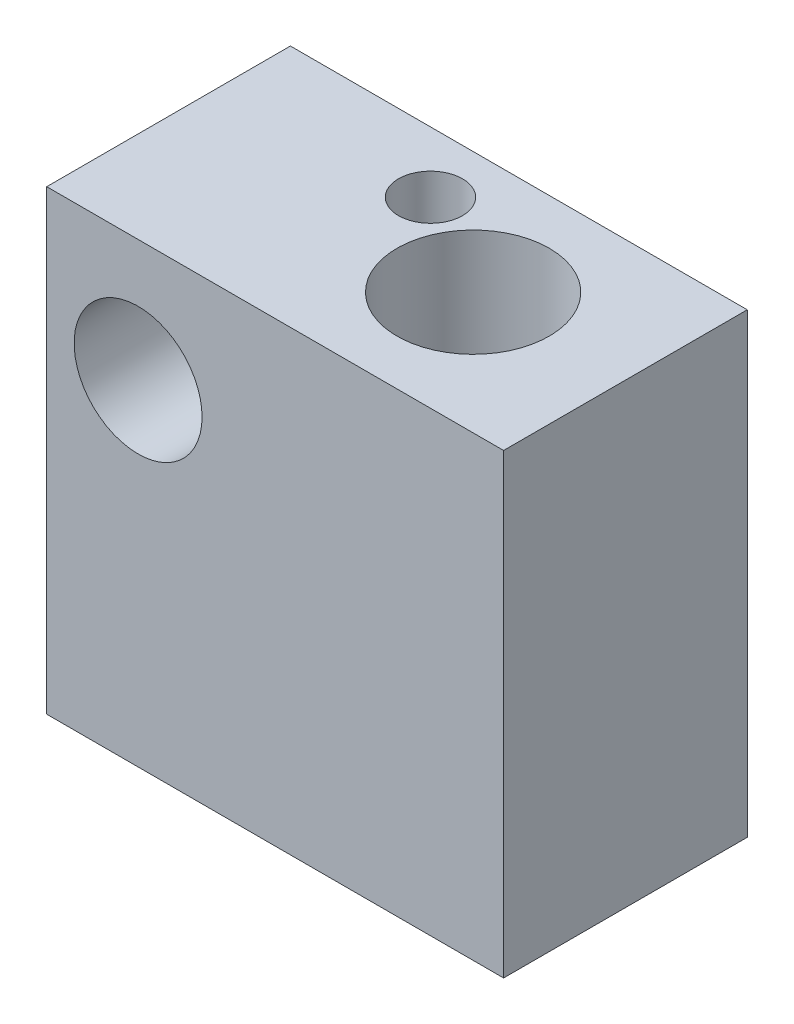
ISO-10303-21;
HEADER;
FILE_DESCRIPTION(('STEP AP214'),'2;1');
FILE_NAME('part.step','',(''),(''),'','','');
FILE_SCHEMA(('AUTOMOTIVE_DESIGN { 1 0 10303 214 1 1 1 1 }'));
ENDSEC;
DATA;
#1=APPLICATION_CONTEXT('core data for automotive mechanical design processes');
#2=APPLICATION_PROTOCOL_DEFINITION('international standard','automotive_design',2000,#1);
#3=PRODUCT_CONTEXT('',#1,'mechanical');
#4=PRODUCT('Part','Part','',(#3));
#5=PRODUCT_RELATED_PRODUCT_CATEGORY('part','',(#4));
#6=PRODUCT_DEFINITION_FORMATION('','',#4);
#7=PRODUCT_DEFINITION_CONTEXT('part definition',#1,'design');
#8=PRODUCT_DEFINITION('design','',#6,#7);
#9=PRODUCT_DEFINITION_SHAPE('','',#8);
#10=(LENGTH_UNIT() NAMED_UNIT(*) SI_UNIT(.MILLI.,.METRE.));
#11=(NAMED_UNIT(*) PLANE_ANGLE_UNIT() SI_UNIT($,.RADIAN.));
#12=(NAMED_UNIT(*) SI_UNIT($,.STERADIAN.) SOLID_ANGLE_UNIT());
#13=UNCERTAINTY_MEASURE_WITH_UNIT(LENGTH_MEASURE(1.E-05),#10,'distance_accuracy_value','');
#14=(GEOMETRIC_REPRESENTATION_CONTEXT(3) GLOBAL_UNCERTAINTY_ASSIGNED_CONTEXT((#13)) GLOBAL_UNIT_ASSIGNED_CONTEXT((#10,
#11,#12)) REPRESENTATION_CONTEXT('',''));
#15=CARTESIAN_POINT('',(0.,0.,0.));
#16=DIRECTION('',(0.,0.,1.));
#17=DIRECTION('',(1.,0.,0.));
#18=AXIS2_PLACEMENT_3D('',#15,#16,#17);
#19=CARTESIAN_POINT('',(0.,0.,8.));
#20=DIRECTION('',(0.,0.,1.));
#21=DIRECTION('',(1.,0.,0.));
#22=AXIS2_PLACEMENT_3D('',#19,#20,#21);
#23=PLANE('',#22);
#24=DIRECTION('',(0.,-1.,0.));
#25=VECTOR('',#24,1.);
#26=CARTESIAN_POINT('',(-3.,4.,8.));
#27=LINE('',#26,#25);
#28=CARTESIAN_POINT('',(-3.,4.,8.));
#29=VERTEX_POINT('',#28);
#30=CARTESIAN_POINT('',(-3.,-11.,8.));
#31=VERTEX_POINT('',#30);
#32=EDGE_CURVE('E94',#29,#31,#27,.T.);
#33=ORIENTED_EDGE('',*,*,#32,.T.);
#34=DIRECTION('',(1.,0.,0.));
#35=VECTOR('',#34,1.);
#36=CARTESIAN_POINT('',(-3.,-11.,8.));
#37=LINE('',#36,#35);
#38=CARTESIAN_POINT('',(12.,-11.,8.));
#39=VERTEX_POINT('',#38);
#40=EDGE_CURVE('E89',#31,#39,#37,.T.);
#41=ORIENTED_EDGE('',*,*,#40,.T.);
#42=DIRECTION('',(0.,1.,0.));
#43=VECTOR('',#42,1.);
#44=CARTESIAN_POINT('',(12.,4.,8.));
#45=LINE('',#44,#43);
#46=CARTESIAN_POINT('',(12.,4.,8.));
#47=VERTEX_POINT('',#46);
#48=EDGE_CURVE('E92',#39,#47,#45,.T.);
#49=ORIENTED_EDGE('',*,*,#48,.T.);
#50=DIRECTION('',(-1.,0.,0.));
#51=VECTOR('',#50,1.);
#52=CARTESIAN_POINT('',(-3.,4.,8.));
#53=LINE('',#52,#51);
#54=EDGE_CURVE('E57',#47,#29,#53,.T.);
#55=ORIENTED_EDGE('',*,*,#54,.T.);
#56=EDGE_LOOP('',(#33,#41,#49,#55));
#57=FACE_BOUND('',#56,.T.);
#58=CARTESIAN_POINT('',(0.,0.,8.));
#59=DIRECTION('',(0.,0.,1.));
#60=DIRECTION('',(1.,0.,0.));
#61=AXIS2_PLACEMENT_3D('',#58,#59,#60);
#62=CIRCLE('',#61,2.1);
#63=CARTESIAN_POINT('',(2.1,0.,8.));
#64=VERTEX_POINT('',#63);
#65=EDGE_CURVE('E112',#64,#64,#62,.T.);
#66=ORIENTED_EDGE('',*,*,#65,.F.);
#67=EDGE_LOOP('',(#66));
#68=FACE_BOUND('',#67,.T.);
#69=ADVANCED_FACE('F39',(#57,#68),#23,.T.);
#70=CARTESIAN_POINT('',(0.,0.,0.));
#71=DIRECTION('',(0.,0.,1.));
#72=DIRECTION('',(1.,0.,0.));
#73=AXIS2_PLACEMENT_3D('',#70,#71,#72);
#74=PLANE('',#73);
#75=DIRECTION('',(0.,-1.,0.));
#76=VECTOR('',#75,1.);
#77=CARTESIAN_POINT('',(-3.,4.,0.));
#78=LINE('',#77,#76);
#79=CARTESIAN_POINT('',(-3.,4.,0.));
#80=VERTEX_POINT('',#79);
#81=CARTESIAN_POINT('',(-3.,-11.,0.));
#82=VERTEX_POINT('',#81);
#83=EDGE_CURVE('E108',#80,#82,#78,.T.);
#84=ORIENTED_EDGE('',*,*,#83,.F.);
#85=DIRECTION('',(-1.,0.,0.));
#86=VECTOR('',#85,1.);
#87=CARTESIAN_POINT('',(-3.,4.,0.));
#88=LINE('',#87,#86);
#89=CARTESIAN_POINT('',(12.,4.,0.));
#90=VERTEX_POINT('',#89);
#91=EDGE_CURVE('E81',#90,#80,#88,.T.);
#92=ORIENTED_EDGE('',*,*,#91,.F.);
#93=DIRECTION('',(0.,1.,0.));
#94=VECTOR('',#93,1.);
#95=CARTESIAN_POINT('',(12.,4.,0.));
#96=LINE('',#95,#94);
#97=CARTESIAN_POINT('',(12.,-11.,0.));
#98=VERTEX_POINT('',#97);
#99=EDGE_CURVE('E75',#98,#90,#96,.T.);
#100=ORIENTED_EDGE('',*,*,#99,.F.);
#101=DIRECTION('',(1.,0.,0.));
#102=VECTOR('',#101,1.);
#103=CARTESIAN_POINT('',(-3.,-11.,0.));
#104=LINE('',#103,#102);
#105=EDGE_CURVE('E99',#82,#98,#104,.T.);
#106=ORIENTED_EDGE('',*,*,#105,.F.);
#107=EDGE_LOOP('',(#84,#92,#100,#106));
#108=FACE_BOUND('',#107,.T.);
#109=CARTESIAN_POINT('',(0.,0.,0.));
#110=DIRECTION('',(0.,0.,1.));
#111=DIRECTION('',(1.,0.,0.));
#112=AXIS2_PLACEMENT_3D('',#109,#110,#111);
#113=CIRCLE('',#112,2.1);
#114=CARTESIAN_POINT('',(2.1,0.,0.));
#115=VERTEX_POINT('',#114);
#116=EDGE_CURVE('E126',#115,#115,#113,.T.);
#117=ORIENTED_EDGE('',*,*,#116,.T.);
#118=EDGE_LOOP('',(#117));
#119=FACE_BOUND('',#118,.T.);
#120=ADVANCED_FACE('F121',(#108,#119),#74,.F.);
#121=CARTESIAN_POINT('',(-3.,4.,8.));
#122=DIRECTION('',(1.,0.,0.));
#123=DIRECTION('',(0.,1.,0.));
#124=AXIS2_PLACEMENT_3D('',#121,#122,#123);
#125=PLANE('',#124);
#126=ORIENTED_EDGE('',*,*,#83,.T.);
#127=DIRECTION('',(0.,0.,-1.));
#128=VECTOR('',#127,1.);
#129=CARTESIAN_POINT('',(-3.,-11.,8.));
#130=LINE('',#129,#128);
#131=EDGE_CURVE('E11',#31,#82,#130,.T.);
#132=ORIENTED_EDGE('',*,*,#131,.F.);
#133=ORIENTED_EDGE('',*,*,#32,.F.);
#134=DIRECTION('',(0.,0.,-1.));
#135=VECTOR('',#134,1.);
#136=CARTESIAN_POINT('',(-3.,4.,8.));
#137=LINE('',#136,#135);
#138=EDGE_CURVE('E104',#29,#80,#137,.T.);
#139=ORIENTED_EDGE('',*,*,#138,.T.);
#140=EDGE_LOOP('',(#126,#132,#133,#139));
#141=FACE_BOUND('',#140,.T.);
#142=ADVANCED_FACE('F41',(#141),#125,.F.);
#143=CARTESIAN_POINT('',(-3.,-11.,8.));
#144=DIRECTION('',(0.,1.,0.));
#145=DIRECTION('',(0.,0.,1.));
#146=AXIS2_PLACEMENT_3D('',#143,#144,#145);
#147=PLANE('',#146);
#148=CARTESIAN_POINT('',(3.6,-11.,2.));
#149=DIRECTION('',(0.,-1.,0.));
#150=DIRECTION('',(0.,0.,-1.));
#151=AXIS2_PLACEMENT_3D('',#148,#149,#150);
#152=CIRCLE('',#151,1.05);
#153=CARTESIAN_POINT('',(3.6,-11.,0.95));
#154=VERTEX_POINT('',#153);
#155=EDGE_CURVE('E140',#154,#154,#152,.T.);
#156=ORIENTED_EDGE('',*,*,#155,.F.);
#157=EDGE_LOOP('',(#156));
#158=FACE_BOUND('',#157,.T.);
#159=CARTESIAN_POINT('',(7.,-11.,4.));
#160=DIRECTION('',(0.,-1.,0.));
#161=DIRECTION('',(0.,0.,-1.));
#162=AXIS2_PLACEMENT_3D('',#159,#160,#161);
#163=CIRCLE('',#162,2.5);
#164=CARTESIAN_POINT('',(7.,-11.,1.5));
#165=VERTEX_POINT('',#164);
#166=EDGE_CURVE('E133',#165,#165,#163,.T.);
#167=ORIENTED_EDGE('',*,*,#166,.F.);
#168=EDGE_LOOP('',(#167));
#169=FACE_BOUND('',#168,.T.);
#170=ORIENTED_EDGE('',*,*,#105,.T.);
#171=DIRECTION('',(0.,0.,-1.));
#172=VECTOR('',#171,1.);
#173=CARTESIAN_POINT('',(12.,-11.,8.));
#174=LINE('',#173,#172);
#175=EDGE_CURVE('E49',#39,#98,#174,.T.);
#176=ORIENTED_EDGE('',*,*,#175,.F.);
#177=ORIENTED_EDGE('',*,*,#40,.F.);
#178=ORIENTED_EDGE('',*,*,#131,.T.);
#179=EDGE_LOOP('',(#170,#176,#177,#178));
#180=FACE_BOUND('',#179,.T.);
#181=ADVANCED_FACE('F98',(#158,#169,#180),#147,.F.);
#182=CARTESIAN_POINT('',(12.,4.,8.));
#183=DIRECTION('',(-1.,0.,0.));
#184=DIRECTION('',(0.,-1.,0.));
#185=AXIS2_PLACEMENT_3D('',#182,#183,#184);
#186=PLANE('',#185);
#187=ORIENTED_EDGE('',*,*,#99,.T.);
#188=DIRECTION('',(0.,0.,-1.));
#189=VECTOR('',#188,1.);
#190=CARTESIAN_POINT('',(12.,4.,8.));
#191=LINE('',#190,#189);
#192=EDGE_CURVE('E100',#47,#90,#191,.T.);
#193=ORIENTED_EDGE('',*,*,#192,.F.);
#194=ORIENTED_EDGE('',*,*,#48,.F.);
#195=ORIENTED_EDGE('',*,*,#175,.T.);
#196=EDGE_LOOP('',(#187,#193,#194,#195));
#197=FACE_BOUND('',#196,.T.);
#198=ADVANCED_FACE('F101',(#197),#186,.F.);
#199=CARTESIAN_POINT('',(-3.,4.,8.));
#200=DIRECTION('',(0.,-1.,0.));
#201=DIRECTION('',(0.,0.,-1.));
#202=AXIS2_PLACEMENT_3D('',#199,#200,#201);
#203=PLANE('',#202);
#204=CARTESIAN_POINT('',(3.6,4.,2.));
#205=DIRECTION('',(0.,-1.,0.));
#206=DIRECTION('',(0.,0.,-1.));
#207=AXIS2_PLACEMENT_3D('',#204,#205,#206);
#208=CIRCLE('',#207,1.05);
#209=CARTESIAN_POINT('',(3.6,4.,0.95));
#210=VERTEX_POINT('',#209);
#211=EDGE_CURVE('E136',#210,#210,#208,.T.);
#212=ORIENTED_EDGE('',*,*,#211,.T.);
#213=EDGE_LOOP('',(#212));
#214=FACE_BOUND('',#213,.T.);
#215=CARTESIAN_POINT('',(7.,4.,4.));
#216=DIRECTION('',(0.,-1.,0.));
#217=DIRECTION('',(0.,0.,-1.));
#218=AXIS2_PLACEMENT_3D('',#215,#216,#217);
#219=CIRCLE('',#218,2.5);
#220=CARTESIAN_POINT('',(7.,4.,1.5));
#221=VERTEX_POINT('',#220);
#222=EDGE_CURVE('E129',#221,#221,#219,.T.);
#223=ORIENTED_EDGE('',*,*,#222,.T.);
#224=EDGE_LOOP('',(#223));
#225=FACE_BOUND('',#224,.T.);
#226=ORIENTED_EDGE('',*,*,#91,.T.);
#227=ORIENTED_EDGE('',*,*,#138,.F.);
#228=ORIENTED_EDGE('',*,*,#54,.F.);
#229=ORIENTED_EDGE('',*,*,#192,.T.);
#230=EDGE_LOOP('',(#226,#227,#228,#229));
#231=FACE_BOUND('',#230,.T.);
#232=ADVANCED_FACE('F118',(#214,#225,#231),#203,.F.);
#233=CARTESIAN_POINT('',(0.,0.,8.));
#234=DIRECTION('',(0.,0.,-1.));
#235=DIRECTION('',(-1.,0.,0.));
#236=AXIS2_PLACEMENT_3D('',#233,#234,#235);
#237=CYLINDRICAL_SURFACE('',#236,2.1);
#238=ORIENTED_EDGE('',*,*,#65,.T.);
#239=EDGE_LOOP('',(#238));
#240=FACE_BOUND('',#239,.T.);
#241=ORIENTED_EDGE('',*,*,#116,.F.);
#242=EDGE_LOOP('',(#241));
#243=FACE_BOUND('',#242,.T.);
#244=ADVANCED_FACE('F160',(#240,#243),#237,.F.);
#245=CARTESIAN_POINT('',(7.,4.,4.));
#246=DIRECTION('',(0.,-1.,0.));
#247=DIRECTION('',(0.,0.,-1.));
#248=AXIS2_PLACEMENT_3D('',#245,#246,#247);
#249=CYLINDRICAL_SURFACE('',#248,2.5);
#250=ORIENTED_EDGE('',*,*,#222,.F.);
#251=EDGE_LOOP('',(#250));
#252=FACE_BOUND('',#251,.T.);
#253=ORIENTED_EDGE('',*,*,#166,.T.);
#254=EDGE_LOOP('',(#253));
#255=FACE_BOUND('',#254,.T.);
#256=ADVANCED_FACE('F151',(#252,#255),#249,.F.);
#257=CARTESIAN_POINT('',(3.6,4.,2.));
#258=DIRECTION('',(0.,-1.,0.));
#259=DIRECTION('',(0.,0.,-1.));
#260=AXIS2_PLACEMENT_3D('',#257,#258,#259);
#261=CYLINDRICAL_SURFACE('',#260,1.05);
#262=ORIENTED_EDGE('',*,*,#211,.F.);
#263=EDGE_LOOP('',(#262));
#264=FACE_BOUND('',#263,.T.);
#265=ORIENTED_EDGE('',*,*,#155,.T.);
#266=EDGE_LOOP('',(#265));
#267=FACE_BOUND('',#266,.T.);
#268=ADVANCED_FACE('F148',(#264,#267),#261,.F.);
#269=CLOSED_SHELL('',(#69,#120,#142,#181,#198,#232,#244,#256,#268));
#270=MANIFOLD_SOLID_BREP('B2',#269);
#271=ADVANCED_BREP_SHAPE_REPRESENTATION('',(#18,#270),#14);
#272=SHAPE_DEFINITION_REPRESENTATION(#9,#271);
ENDSEC;
END-ISO-10303-21;
